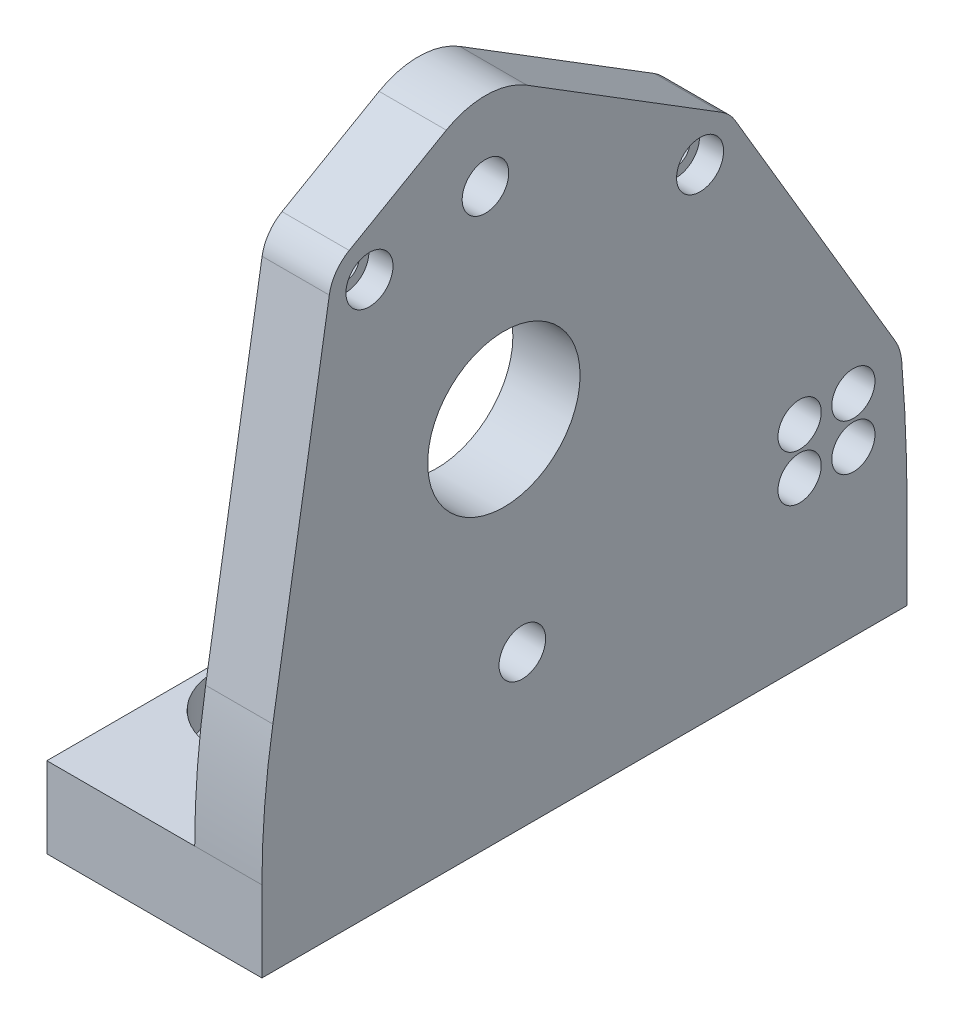
ISO-10303-21;
HEADER;
FILE_DESCRIPTION(('STEP AP214'),'2;1');
FILE_NAME('part.step','',(''),(''),'','','');
FILE_SCHEMA(('AUTOMOTIVE_DESIGN { 1 0 10303 214 1 1 1 1 }'));
ENDSEC;
DATA;
#1=APPLICATION_CONTEXT('core data for automotive mechanical design processes');
#2=APPLICATION_PROTOCOL_DEFINITION('international standard','automotive_design',2000,#1);
#3=PRODUCT_CONTEXT('',#1,'mechanical');
#4=PRODUCT('Part','Part','',(#3));
#5=PRODUCT_RELATED_PRODUCT_CATEGORY('part','',(#4));
#6=PRODUCT_DEFINITION_FORMATION('','',#4);
#7=PRODUCT_DEFINITION_CONTEXT('part definition',#1,'design');
#8=PRODUCT_DEFINITION('design','',#6,#7);
#9=PRODUCT_DEFINITION_SHAPE('','',#8);
#10=(LENGTH_UNIT() NAMED_UNIT(*) SI_UNIT(.MILLI.,.METRE.));
#11=(NAMED_UNIT(*) PLANE_ANGLE_UNIT() SI_UNIT($,.RADIAN.));
#12=(NAMED_UNIT(*) SI_UNIT($,.STERADIAN.) SOLID_ANGLE_UNIT());
#13=UNCERTAINTY_MEASURE_WITH_UNIT(LENGTH_MEASURE(1.E-05),#10,'distance_accuracy_value','');
#14=(GEOMETRIC_REPRESENTATION_CONTEXT(3) GLOBAL_UNCERTAINTY_ASSIGNED_CONTEXT((#13)) GLOBAL_UNIT_ASSIGNED_CONTEXT((#10,
#11,#12)) REPRESENTATION_CONTEXT('',''));
#15=CARTESIAN_POINT('',(0.,0.,0.));
#16=DIRECTION('',(0.,0.,1.));
#17=DIRECTION('',(1.,0.,0.));
#18=AXIS2_PLACEMENT_3D('',#15,#16,#17);
#19=CARTESIAN_POINT('',(25.4,79.375,76.2));
#20=DIRECTION('',(-1.,0.,0.));
#21=DIRECTION('',(0.,-1.,0.));
#22=AXIS2_PLACEMENT_3D('',#19,#20,#21);
#23=PLANE('',#22);
#24=CARTESIAN_POINT('',(25.4,42.8625,47.625));
#25=DIRECTION('',(1.,0.,0.));
#26=DIRECTION('',(0.,0.,-1.));
#27=AXIS2_PLACEMENT_3D('',#24,#25,#26);
#28=CIRCLE('',#27,8.99999999999999);
#29=CARTESIAN_POINT('',(25.4,42.8625,38.625));
#30=VERTEX_POINT('',#29);
#31=EDGE_CURVE('E282',#30,#30,#28,.T.);
#32=ORIENTED_EDGE('',*,*,#31,.F.);
#33=EDGE_LOOP('',(#32));
#34=FACE_BOUND('',#33,.T.);
#35=CARTESIAN_POINT('',(25.4,17.957632509851,45.4461064279965));
#36=DIRECTION('',(-1.,0.,0.));
#37=DIRECTION('',(0.,-1.,0.));
#38=AXIS2_PLACEMENT_3D('',#35,#36,#37);
#39=CIRCLE('',#38,2.74999999999999);
#40=CARTESIAN_POINT('',(25.4,15.207632509851,45.4461064279965));
#41=VERTEX_POINT('',#40);
#42=EDGE_CURVE('E281',#41,#41,#39,.T.);
#43=ORIENTED_EDGE('',*,*,#42,.T.);
#44=EDGE_LOOP('',(#43));
#45=FACE_BOUND('',#44,.T.);
#46=CARTESIAN_POINT('',(25.4,67.767367490149,49.8038935720035));
#47=DIRECTION('',(-1.,0.,0.));
#48=DIRECTION('',(0.,-1.,0.));
#49=AXIS2_PLACEMENT_3D('',#46,#47,#48);
#50=CIRCLE('',#49,2.74999999999999);
#51=CARTESIAN_POINT('',(25.4,65.017367490149,49.8038935720035));
#52=VERTEX_POINT('',#51);
#53=EDGE_CURVE('E271',#52,#52,#50,.T.);
#54=ORIENTED_EDGE('',*,*,#53,.T.);
#55=EDGE_LOOP('',(#54));
#56=FACE_BOUND('',#55,.T.);
#57=CARTESIAN_POINT('',(25.4,65.0875,63.5));
#58=DIRECTION('',(1.,0.,0.));
#59=DIRECTION('',(0.,0.,-1.));
#60=AXIS2_PLACEMENT_3D('',#57,#58,#59);
#61=CIRCLE('',#60,2.77876000000001);
#62=CARTESIAN_POINT('',(25.4,65.0875,60.72124));
#63=VERTEX_POINT('',#62);
#64=EDGE_CURVE('E252',#63,#63,#61,.T.);
#65=ORIENTED_EDGE('',*,*,#64,.F.);
#66=EDGE_LOOP('',(#65));
#67=FACE_BOUND('',#66,.T.);
#68=CARTESIAN_POINT('',(25.4,57.3206231212675,24.4532731370692));
#69=DIRECTION('',(1.,0.,0.));
#70=DIRECTION('',(0.,0.,-1.));
#71=AXIS2_PLACEMENT_3D('',#68,#69,#70);
#72=CIRCLE('',#71,2.77876);
#73=CARTESIAN_POINT('',(25.4,57.3206231212675,21.6745131370692));
#74=VERTEX_POINT('',#73);
#75=EDGE_CURVE('E242',#74,#74,#72,.T.);
#76=ORIENTED_EDGE('',*,*,#75,.F.);
#77=EDGE_LOOP('',(#76));
#78=FACE_BOUND('',#77,.T.);
#79=CARTESIAN_POINT('',(25.4,19.3959598742133,12.7));
#80=DIRECTION('',(-1.,0.,0.));
#81=DIRECTION('',(0.,0.,1.));
#82=AXIS2_PLACEMENT_3D('',#79,#80,#81);
#83=CIRCLE('',#82,2.5527);
#84=CARTESIAN_POINT('',(25.4,19.3959598742133,15.2527));
#85=VERTEX_POINT('',#84);
#86=EDGE_CURVE('E239',#85,#85,#83,.T.);
#87=ORIENTED_EDGE('',*,*,#86,.T.);
#88=EDGE_LOOP('',(#87));
#89=FACE_BOUND('',#88,.T.);
#90=CARTESIAN_POINT('',(25.4,19.3959598742133,6.35));
#91=DIRECTION('',(-1.,0.,0.));
#92=DIRECTION('',(0.,0.,1.));
#93=AXIS2_PLACEMENT_3D('',#90,#91,#92);
#94=CIRCLE('',#93,2.5527);
#95=CARTESIAN_POINT('',(25.4,19.3959598742133,8.9027));
#96=VERTEX_POINT('',#95);
#97=EDGE_CURVE('E233',#96,#96,#94,.T.);
#98=ORIENTED_EDGE('',*,*,#97,.T.);
#99=EDGE_LOOP('',(#98));
#100=FACE_BOUND('',#99,.T.);
#101=CARTESIAN_POINT('',(25.4,24.8635494141295,12.7));
#102=DIRECTION('',(-1.,0.,0.));
#103=DIRECTION('',(0.,0.,1.));
#104=AXIS2_PLACEMENT_3D('',#101,#102,#103);
#105=CIRCLE('',#104,2.5527);
#106=CARTESIAN_POINT('',(25.4,24.8635494141295,15.2527));
#107=VERTEX_POINT('',#106);
#108=EDGE_CURVE('E227',#107,#107,#105,.T.);
#109=ORIENTED_EDGE('',*,*,#108,.T.);
#110=EDGE_LOOP('',(#109));
#111=FACE_BOUND('',#110,.T.);
#112=CARTESIAN_POINT('',(25.4,24.8635494141295,6.35));
#113=DIRECTION('',(-1.,0.,0.));
#114=DIRECTION('',(0.,0.,1.));
#115=AXIS2_PLACEMENT_3D('',#112,#113,#114);
#116=CIRCLE('',#115,2.5527);
#117=CARTESIAN_POINT('',(25.4,24.8635494141295,8.9027));
#118=VERTEX_POINT('',#117);
#119=EDGE_CURVE('E221',#118,#118,#116,.T.);
#120=ORIENTED_EDGE('',*,*,#119,.T.);
#121=EDGE_LOOP('',(#120));
#122=FACE_BOUND('',#121,.T.);
#123=CARTESIAN_POINT('',(25.4,9.525,195.072353237744));
#124=DIRECTION('',(1.,0.,0.));
#125=DIRECTION('',(0.,0.,-1.));
#126=AXIS2_PLACEMENT_3D('',#123,#124,#125);
#127=CIRCLE('',#126,195.072353237744);
#128=CARTESIAN_POINT('',(25.4,9.52500000000002,0.));
#129=VERTEX_POINT('',#128);
#130=CARTESIAN_POINT('',(25.4,25.3275424975202,0.641124654665709));
#131=VERTEX_POINT('',#130);
#132=EDGE_CURVE('E48',#129,#131,#127,.T.);
#133=ORIENTED_EDGE('',*,*,#132,.T.);
#134=CARTESIAN_POINT('',(25.4,24.8635494141295,6.35));
#135=DIRECTION('',(1.,0.,0.));
#136=DIRECTION('',(0.,0.,-1.));
#137=AXIS2_PLACEMENT_3D('',#134,#135,#136);
#138=CIRCLE('',#137,5.7277);
#139=CARTESIAN_POINT('',(25.4,27.7766647313883,1.41843772843205));
#140=VERTEX_POINT('',#139);
#141=EDGE_CURVE('E181',#140,#131,#138,.F.);
#142=ORIENTED_EDGE('',*,*,#141,.F.);
#143=DIRECTION('',(0.,-0.861002194871929,-0.508601239111468));
#144=VECTOR('',#143,1.);
#145=CARTESIAN_POINT('',(25.4,6.56399136927082,-11.1120668638873));
#146=LINE('',#145,#144);
#147=CARTESIAN_POINT('',(25.4,59.7654438476144,20.3144786364296));
#148=VERTEX_POINT('',#147);
#149=EDGE_CURVE('E179',#148,#140,#146,.T.);
#150=ORIENTED_EDGE('',*,*,#149,.F.);
#151=CARTESIAN_POINT('',(25.4,57.3206231212675,24.4532731370692));
#152=DIRECTION('',(1.,0.,0.));
#153=DIRECTION('',(0.,0.,-1.));
#154=AXIS2_PLACEMENT_3D('',#151,#152,#153);
#155=CIRCLE('',#154,4.80694999999999);
#156=CARTESIAN_POINT('',(25.4,61.4052649655,21.9190140132136));
#157=VERTEX_POINT('',#156);
#158=EDGE_CURVE('E177',#157,#148,#155,.F.);
#159=ORIENTED_EDGE('',*,*,#158,.F.);
#160=DIRECTION('',(0.,0.527207298568868,0.849736702947281));
#161=VECTOR('',#160,1.);
#162=CARTESIAN_POINT('',(25.4,34.5183809760836,-21.416448556655));
#163=LINE('',#162,#161);
#164=CARTESIAN_POINT('',(25.4,75.665670144044,44.9035017318059));
#165=VERTEX_POINT('',#164);
#166=EDGE_CURVE('E174',#157,#165,#163,.T.);
#167=ORIENTED_EDGE('',*,*,#166,.T.);
#168=CARTESIAN_POINT('',(25.4,67.767367490149,49.8038935720035));
#169=DIRECTION('',(1.,0.,0.));
#170=DIRECTION('',(0.,0.,-1.));
#171=AXIS2_PLACEMENT_3D('',#168,#169,#170);
#172=CIRCLE('',#171,9.295);
#173=CARTESIAN_POINT('',(25.4,75.8308211157401,54.4275004571034));
#174=VERTEX_POINT('',#173);
#175=EDGE_CURVE('E172',#174,#165,#172,.F.);
#176=ORIENTED_EDGE('',*,*,#175,.F.);
#177=DIRECTION('',(0.,-0.497429465852599,0.867504424485315));
#178=VECTOR('',#177,1.);
#179=CARTESIAN_POINT('',(25.4,80.55421862798,46.1900144982694));
#180=LINE('',#179,#178);
#181=CARTESIAN_POINT('',(25.4,69.2575503932797,65.8911185708802));
#182=VERTEX_POINT('',#181);
#183=EDGE_CURVE('E167',#174,#182,#180,.T.);
#184=ORIENTED_EDGE('',*,*,#183,.T.);
#185=CARTESIAN_POINT('',(25.4,65.0875,63.5));
#186=DIRECTION('',(1.,0.,0.));
#187=DIRECTION('',(0.,0.,-1.));
#188=AXIS2_PLACEMENT_3D('',#185,#186,#187);
#189=CIRCLE('',#188,4.80694999999999);
#190=CARTESIAN_POINT('',(25.4,65.8674554174675,68.2432518222484));
#191=VERTEX_POINT('',#190);
#192=EDGE_CURVE('E165',#191,#182,#189,.F.);
#193=ORIENTED_EDGE('',*,*,#192,.F.);
#194=DIRECTION('',(0.,-0.986748733032055,0.162255779125535));
#195=VECTOR('',#194,1.);
#196=CARTESIAN_POINT('',(25.4,12.6602209498388,76.9923700067049));
#197=LINE('',#196,#195);
#198=CARTESIAN_POINT('',(25.4,25.3275424975202,74.9094221818446));
#199=VERTEX_POINT('',#198);
#200=EDGE_CURVE('E150',#191,#199,#197,.T.);
#201=ORIENTED_EDGE('',*,*,#200,.T.);
#202=CARTESIAN_POINT('',(25.4,9.525,-21.192786763509));
#203=DIRECTION('',(1.,0.,0.));
#204=DIRECTION('',(0.,0.,-1.));
#205=AXIS2_PLACEMENT_3D('',#202,#203,#204);
#206=CIRCLE('',#205,97.392786763509);
#207=CARTESIAN_POINT('',(25.4,9.525,76.2));
#208=VERTEX_POINT('',#207);
#209=EDGE_CURVE('E158',#199,#208,#206,.T.);
#210=ORIENTED_EDGE('',*,*,#209,.T.);
#211=DIRECTION('',(0.,1.,0.));
#212=VECTOR('',#211,1.);
#213=CARTESIAN_POINT('',(25.4,79.375,76.2));
#214=LINE('',#213,#212);
#215=CARTESIAN_POINT('',(25.4,0.,76.2));
#216=VERTEX_POINT('',#215);
#217=EDGE_CURVE('E81',#216,#208,#214,.T.);
#218=ORIENTED_EDGE('',*,*,#217,.F.);
#219=DIRECTION('',(0.,0.,-1.));
#220=VECTOR('',#219,1.);
#221=CARTESIAN_POINT('',(25.4,0.,76.2));
#222=LINE('',#221,#220);
#223=CARTESIAN_POINT('',(25.4,0.,0.));
#224=VERTEX_POINT('',#223);
#225=EDGE_CURVE('E310',#216,#224,#222,.T.);
#226=ORIENTED_EDGE('',*,*,#225,.T.);
#227=DIRECTION('',(0.,1.,0.));
#228=VECTOR('',#227,1.);
#229=CARTESIAN_POINT('',(25.4,79.375,0.));
#230=LINE('',#229,#228);
#231=EDGE_CURVE('E298',#224,#129,#230,.T.);
#232=ORIENTED_EDGE('',*,*,#231,.T.);
#233=EDGE_LOOP('',(#133,#142,#150,#159,#167,#176,#184,#193,#201,#210,#218,#226,#232));
#234=FACE_BOUND('',#233,.T.);
#235=ADVANCED_FACE('F33',(#34,#45,#56,#67,#78,#89,#100,#111,#122,#234),#23,.F.);
#236=CARTESIAN_POINT('',(17.4625,9.525,76.2));
#237=DIRECTION('',(1.,0.,0.));
#238=DIRECTION('',(0.,0.,-1.));
#239=AXIS2_PLACEMENT_3D('',#236,#237,#238);
#240=PLANE('',#239);
#241=CARTESIAN_POINT('',(17.4625,42.8625,47.625));
#242=DIRECTION('',(1.,0.,0.));
#243=DIRECTION('',(0.,0.,-1.));
#244=AXIS2_PLACEMENT_3D('',#241,#242,#243);
#245=CIRCLE('',#244,8.99999999999999);
#246=CARTESIAN_POINT('',(17.4625,42.8625,38.625));
#247=VERTEX_POINT('',#246);
#248=EDGE_CURVE('E285',#247,#247,#245,.T.);
#249=ORIENTED_EDGE('',*,*,#248,.T.);
#250=EDGE_LOOP('',(#249));
#251=FACE_BOUND('',#250,.T.);
#252=CARTESIAN_POINT('',(17.4625,17.957632509851,45.4461064279965));
#253=DIRECTION('',(-1.,0.,0.));
#254=DIRECTION('',(0.,0.,1.));
#255=AXIS2_PLACEMENT_3D('',#252,#253,#254);
#256=CIRCLE('',#255,6.12);
#257=CARTESIAN_POINT('',(17.4625,17.957632509851,51.5661064279965));
#258=VERTEX_POINT('',#257);
#259=EDGE_CURVE('E272',#258,#258,#256,.T.);
#260=ORIENTED_EDGE('',*,*,#259,.F.);
#261=EDGE_LOOP('',(#260));
#262=FACE_BOUND('',#261,.T.);
#263=CARTESIAN_POINT('',(17.4625,67.767367490149,49.8038935720035));
#264=DIRECTION('',(-1.,0.,0.));
#265=DIRECTION('',(0.,0.,1.));
#266=AXIS2_PLACEMENT_3D('',#263,#264,#265);
#267=CIRCLE('',#266,6.12);
#268=CARTESIAN_POINT('',(17.4625,67.767367490149,55.9238935720035));
#269=VERTEX_POINT('',#268);
#270=EDGE_CURVE('E262',#269,#269,#267,.T.);
#271=ORIENTED_EDGE('',*,*,#270,.F.);
#272=EDGE_LOOP('',(#271));
#273=FACE_BOUND('',#272,.T.);
#274=CARTESIAN_POINT('',(17.4625,65.0875,63.5));
#275=DIRECTION('',(1.,0.,0.));
#276=DIRECTION('',(0.,0.,-1.));
#277=AXIS2_PLACEMENT_3D('',#274,#275,#276);
#278=CIRCLE('',#277,1.63194999999999);
#279=CARTESIAN_POINT('',(17.4625,65.0875,61.86805));
#280=VERTEX_POINT('',#279);
#281=EDGE_CURVE('E261',#280,#280,#278,.T.);
#282=ORIENTED_EDGE('',*,*,#281,.T.);
#283=EDGE_LOOP('',(#282));
#284=FACE_BOUND('',#283,.T.);
#285=CARTESIAN_POINT('',(17.4625,57.3206231212675,24.4532731370692));
#286=DIRECTION('',(1.,0.,0.));
#287=DIRECTION('',(0.,0.,-1.));
#288=AXIS2_PLACEMENT_3D('',#285,#286,#287);
#289=CIRCLE('',#288,1.63194999999999);
#290=CARTESIAN_POINT('',(17.4625,57.3206231212675,22.8213231370692));
#291=VERTEX_POINT('',#290);
#292=EDGE_CURVE('E251',#291,#291,#289,.T.);
#293=ORIENTED_EDGE('',*,*,#292,.T.);
#294=EDGE_LOOP('',(#293));
#295=FACE_BOUND('',#294,.T.);
#296=CARTESIAN_POINT('',(17.4625,19.3959598742133,12.7));
#297=DIRECTION('',(-1.,0.,0.));
#298=DIRECTION('',(0.,0.,1.));
#299=AXIS2_PLACEMENT_3D('',#296,#297,#298);
#300=CIRCLE('',#299,2.5527);
#301=CARTESIAN_POINT('',(17.4625,19.3959598742133,15.2527));
#302=VERTEX_POINT('',#301);
#303=EDGE_CURVE('E236',#302,#302,#300,.T.);
#304=ORIENTED_EDGE('',*,*,#303,.F.);
#305=EDGE_LOOP('',(#304));
#306=FACE_BOUND('',#305,.T.);
#307=CARTESIAN_POINT('',(17.4625,19.3959598742133,6.35));
#308=DIRECTION('',(-1.,0.,0.));
#309=DIRECTION('',(0.,0.,1.));
#310=AXIS2_PLACEMENT_3D('',#307,#308,#309);
#311=CIRCLE('',#310,2.5527);
#312=CARTESIAN_POINT('',(17.4625,19.3959598742133,8.9027));
#313=VERTEX_POINT('',#312);
#314=EDGE_CURVE('E230',#313,#313,#311,.T.);
#315=ORIENTED_EDGE('',*,*,#314,.F.);
#316=EDGE_LOOP('',(#315));
#317=FACE_BOUND('',#316,.T.);
#318=CARTESIAN_POINT('',(17.4625,24.8635494141295,12.7));
#319=DIRECTION('',(-1.,0.,0.));
#320=DIRECTION('',(0.,0.,1.));
#321=AXIS2_PLACEMENT_3D('',#318,#319,#320);
#322=CIRCLE('',#321,2.5527);
#323=CARTESIAN_POINT('',(17.4625,24.8635494141295,15.2527));
#324=VERTEX_POINT('',#323);
#325=EDGE_CURVE('E224',#324,#324,#322,.T.);
#326=ORIENTED_EDGE('',*,*,#325,.F.);
#327=EDGE_LOOP('',(#326));
#328=FACE_BOUND('',#327,.T.);
#329=CARTESIAN_POINT('',(17.4625,24.8635494141295,6.35));
#330=DIRECTION('',(-1.,0.,0.));
#331=DIRECTION('',(0.,0.,1.));
#332=AXIS2_PLACEMENT_3D('',#329,#330,#331);
#333=CIRCLE('',#332,2.5527);
#334=CARTESIAN_POINT('',(17.4625,24.8635494141295,8.9027));
#335=VERTEX_POINT('',#334);
#336=EDGE_CURVE('E218',#335,#335,#333,.T.);
#337=ORIENTED_EDGE('',*,*,#336,.F.);
#338=EDGE_LOOP('',(#337));
#339=FACE_BOUND('',#338,.T.);
#340=CARTESIAN_POINT('',(17.4625,9.525,195.072353237744));
#341=DIRECTION('',(1.,0.,0.));
#342=DIRECTION('',(0.,0.,-1.));
#343=AXIS2_PLACEMENT_3D('',#340,#341,#342);
#344=CIRCLE('',#343,195.072353237744);
#345=CARTESIAN_POINT('',(17.4625,9.525,0.));
#346=VERTEX_POINT('',#345);
#347=CARTESIAN_POINT('',(17.4625,25.3275424975202,0.641124654665709));
#348=VERTEX_POINT('',#347);
#349=EDGE_CURVE('E211',#346,#348,#344,.T.);
#350=ORIENTED_EDGE('',*,*,#349,.F.);
#351=DIRECTION('',(0.,0.,-1.));
#352=VECTOR('',#351,1.);
#353=CARTESIAN_POINT('',(17.4625,9.525,76.2));
#354=LINE('',#353,#352);
#355=CARTESIAN_POINT('',(17.4625,9.525,76.2));
#356=VERTEX_POINT('',#355);
#357=EDGE_CURVE('E307',#356,#346,#354,.T.);
#358=ORIENTED_EDGE('',*,*,#357,.F.);
#359=CARTESIAN_POINT('',(17.4625,9.525,-21.192786763509));
#360=DIRECTION('',(1.,0.,0.));
#361=DIRECTION('',(0.,0.,-1.));
#362=AXIS2_PLACEMENT_3D('',#359,#360,#361);
#363=CIRCLE('',#362,97.392786763509);
#364=CARTESIAN_POINT('',(17.4625,25.3275424975202,74.9094221818446));
#365=VERTEX_POINT('',#364);
#366=EDGE_CURVE('E216',#356,#365,#363,.F.);
#367=ORIENTED_EDGE('',*,*,#366,.T.);
#368=DIRECTION('',(0.,0.986748733032055,-0.162255779125535));
#369=VECTOR('',#368,1.);
#370=CARTESIAN_POINT('',(17.4625,9.73440370940694,77.4734760269442));
#371=LINE('',#370,#369);
#372=CARTESIAN_POINT('',(17.4625,65.8674554174675,68.2432518222484));
#373=VERTEX_POINT('',#372);
#374=EDGE_CURVE('E41',#365,#373,#371,.T.);
#375=ORIENTED_EDGE('',*,*,#374,.T.);
#376=CARTESIAN_POINT('',(17.4625,65.0875,63.5));
#377=DIRECTION('',(1.,0.,0.));
#378=DIRECTION('',(0.,0.,-1.));
#379=AXIS2_PLACEMENT_3D('',#376,#377,#378);
#380=CIRCLE('',#379,4.80694999999999);
#381=CARTESIAN_POINT('',(17.4625,69.2575503932797,65.8911185708802));
#382=VERTEX_POINT('',#381);
#383=EDGE_CURVE('E332',#382,#373,#380,.T.);
#384=ORIENTED_EDGE('',*,*,#383,.F.);
#385=DIRECTION('',(0.,0.497429465852599,-0.867504424485315));
#386=VECTOR('',#385,1.);
#387=CARTESIAN_POINT('',(17.4625,50.0290508258192,99.425136147412));
#388=LINE('',#387,#386);
#389=CARTESIAN_POINT('',(17.4625,75.8308211157401,54.4275004571034));
#390=VERTEX_POINT('',#389);
#391=EDGE_CURVE('E329',#382,#390,#388,.T.);
#392=ORIENTED_EDGE('',*,*,#391,.T.);
#393=CARTESIAN_POINT('',(17.4625,67.767367490149,49.8038935720035));
#394=DIRECTION('',(1.,0.,0.));
#395=DIRECTION('',(0.,0.,-1.));
#396=AXIS2_PLACEMENT_3D('',#393,#394,#395);
#397=CIRCLE('',#396,9.295);
#398=CARTESIAN_POINT('',(17.4625,75.665670144044,44.9035017318059));
#399=VERTEX_POINT('',#398);
#400=EDGE_CURVE('E327',#399,#390,#397,.T.);
#401=ORIENTED_EDGE('',*,*,#400,.F.);
#402=DIRECTION('',(0.,-0.527207298568868,-0.849736702947281));
#403=VECTOR('',#402,1.);
#404=CARTESIAN_POINT('',(17.4625,71.3024704974467,37.8710291312467));
#405=LINE('',#404,#403);
#406=CARTESIAN_POINT('',(17.4625,61.4052649655,21.9190140132136));
#407=VERTEX_POINT('',#406);
#408=EDGE_CURVE('E324',#399,#407,#405,.T.);
#409=ORIENTED_EDGE('',*,*,#408,.T.);
#410=CARTESIAN_POINT('',(17.4625,57.3206231212675,24.4532731370692));
#411=DIRECTION('',(1.,0.,0.));
#412=DIRECTION('',(0.,0.,-1.));
#413=AXIS2_PLACEMENT_3D('',#410,#411,#412);
#414=CIRCLE('',#413,4.80694999999999);
#415=CARTESIAN_POINT('',(17.4625,59.7654438476144,20.3144786364296));
#416=VERTEX_POINT('',#415);
#417=EDGE_CURVE('E322',#416,#407,#414,.T.);
#418=ORIENTED_EDGE('',*,*,#417,.F.);
#419=DIRECTION('',(0.,0.861002194871929,0.508601239111468));
#420=VECTOR('',#419,1.);
#421=CARTESIAN_POINT('',(17.4625,46.9936067737601,12.7700470424331));
#422=LINE('',#421,#420);
#423=CARTESIAN_POINT('',(17.4625,27.7766647313883,1.41843772843204));
#424=VERTEX_POINT('',#423);
#425=EDGE_CURVE('E312',#424,#416,#422,.T.);
#426=ORIENTED_EDGE('',*,*,#425,.F.);
#427=CARTESIAN_POINT('',(17.4625,24.8635494141295,6.35));
#428=DIRECTION('',(1.,0.,0.));
#429=DIRECTION('',(0.,0.,-1.));
#430=AXIS2_PLACEMENT_3D('',#427,#428,#429);
#431=CIRCLE('',#430,5.7277);
#432=EDGE_CURVE('E11',#424,#348,#431,.F.);
#433=ORIENTED_EDGE('',*,*,#432,.T.);
#434=EDGE_LOOP('',(#350,#358,#367,#375,#384,#392,#401,#409,#418,#426,#433));
#435=FACE_BOUND('',#434,.T.);
#436=ADVANCED_FACE('F336',(#251,#262,#273,#284,#295,#306,#317,#328,#339,#435),#240,.F.);
#437=CARTESIAN_POINT('',(0.,0.,76.2));
#438=DIRECTION('',(0.,0.,-1.));
#439=DIRECTION('',(-1.,0.,0.));
#440=AXIS2_PLACEMENT_3D('',#437,#438,#439);
#441=PLANE('',#440);
#442=DIRECTION('',(-1.,0.,0.));
#443=VECTOR('',#442,1.);
#444=CARTESIAN_POINT('',(25.4,9.525,76.2));
#445=LINE('',#444,#443);
#446=EDGE_CURVE('E161',#208,#356,#445,.T.);
#447=ORIENTED_EDGE('',*,*,#446,.T.);
#448=DIRECTION('',(-1.,0.,0.));
#449=VECTOR('',#448,1.);
#450=CARTESIAN_POINT('',(0.,9.525,76.2));
#451=LINE('',#450,#449);
#452=CARTESIAN_POINT('',(0.,9.525,76.2));
#453=VERTEX_POINT('',#452);
#454=EDGE_CURVE('E292',#356,#453,#451,.T.);
#455=ORIENTED_EDGE('',*,*,#454,.T.);
#456=DIRECTION('',(0.,-1.,0.));
#457=VECTOR('',#456,1.);
#458=CARTESIAN_POINT('',(0.,0.,76.2));
#459=LINE('',#458,#457);
#460=CARTESIAN_POINT('',(0.,0.,76.2));
#461=VERTEX_POINT('',#460);
#462=EDGE_CURVE('E57',#453,#461,#459,.T.);
#463=ORIENTED_EDGE('',*,*,#462,.T.);
#464=DIRECTION('',(1.,0.,0.));
#465=VECTOR('',#464,1.);
#466=CARTESIAN_POINT('',(25.4,0.,76.2));
#467=LINE('',#466,#465);
#468=EDGE_CURVE('E289',#461,#216,#467,.T.);
#469=ORIENTED_EDGE('',*,*,#468,.T.);
#470=ORIENTED_EDGE('',*,*,#217,.T.);
#471=EDGE_LOOP('',(#447,#455,#463,#469,#470));
#472=FACE_BOUND('',#471,.T.);
#473=ADVANCED_FACE('F339',(#472),#441,.F.);
#474=CARTESIAN_POINT('',(0.,0.,0.));
#475=DIRECTION('',(0.,0.,-1.));
#476=DIRECTION('',(-1.,0.,0.));
#477=AXIS2_PLACEMENT_3D('',#474,#475,#476);
#478=PLANE('',#477);
#479=DIRECTION('',(-1.,0.,0.));
#480=VECTOR('',#479,1.);
#481=CARTESIAN_POINT('',(0.,9.525,0.));
#482=LINE('',#481,#480);
#483=CARTESIAN_POINT('',(0.,9.525,0.));
#484=VERTEX_POINT('',#483);
#485=EDGE_CURVE('E301',#346,#484,#482,.T.);
#486=ORIENTED_EDGE('',*,*,#485,.F.);
#487=DIRECTION('',(-1.,0.,0.));
#488=VECTOR('',#487,1.);
#489=CARTESIAN_POINT('',(25.4,9.525,0.));
#490=LINE('',#489,#488);
#491=EDGE_CURVE('E186',#129,#346,#490,.T.);
#492=ORIENTED_EDGE('',*,*,#491,.F.);
#493=ORIENTED_EDGE('',*,*,#231,.F.);
#494=DIRECTION('',(1.,0.,0.));
#495=VECTOR('',#494,1.);
#496=CARTESIAN_POINT('',(25.4,0.,0.));
#497=LINE('',#496,#495);
#498=CARTESIAN_POINT('',(0.,0.,0.));
#499=VERTEX_POINT('',#498);
#500=EDGE_CURVE('E288',#499,#224,#497,.T.);
#501=ORIENTED_EDGE('',*,*,#500,.F.);
#502=DIRECTION('',(0.,-1.,0.));
#503=VECTOR('',#502,1.);
#504=CARTESIAN_POINT('',(0.,0.,0.));
#505=LINE('',#504,#503);
#506=EDGE_CURVE('E74',#484,#499,#505,.T.);
#507=ORIENTED_EDGE('',*,*,#506,.F.);
#508=EDGE_LOOP('',(#486,#492,#493,#501,#507));
#509=FACE_BOUND('',#508,.T.);
#510=ADVANCED_FACE('F348',(#509),#478,.T.);
#511=CARTESIAN_POINT('',(25.4,0.,76.2));
#512=DIRECTION('',(0.,1.,0.));
#513=DIRECTION('',(0.,0.,1.));
#514=AXIS2_PLACEMENT_3D('',#511,#512,#513);
#515=PLANE('',#514);
#516=CARTESIAN_POINT('',(8.73124999999999,0.,19.05));
#517=DIRECTION('',(0.,1.,0.));
#518=DIRECTION('',(0.,0.,1.));
#519=AXIS2_PLACEMENT_3D('',#516,#517,#518);
#520=CIRCLE('',#519,3.3782);
#521=CARTESIAN_POINT('',(8.73124999999999,0.,22.4282));
#522=VERTEX_POINT('',#521);
#523=EDGE_CURVE('E477',#522,#522,#520,.T.);
#524=ORIENTED_EDGE('',*,*,#523,.T.);
#525=EDGE_LOOP('',(#524));
#526=FACE_BOUND('',#525,.T.);
#527=CARTESIAN_POINT('',(8.73124999999999,0.,57.15));
#528=DIRECTION('',(0.,1.,0.));
#529=DIRECTION('',(0.,0.,1.));
#530=AXIS2_PLACEMENT_3D('',#527,#528,#529);
#531=CIRCLE('',#530,3.3782);
#532=CARTESIAN_POINT('',(8.73124999999999,0.,60.5282));
#533=VERTEX_POINT('',#532);
#534=EDGE_CURVE('E162',#533,#533,#531,.T.);
#535=ORIENTED_EDGE('',*,*,#534,.T.);
#536=EDGE_LOOP('',(#535));
#537=FACE_BOUND('',#536,.T.);
#538=ORIENTED_EDGE('',*,*,#500,.T.);
#539=ORIENTED_EDGE('',*,*,#225,.F.);
#540=ORIENTED_EDGE('',*,*,#468,.F.);
#541=DIRECTION('',(0.,0.,-1.));
#542=VECTOR('',#541,1.);
#543=CARTESIAN_POINT('',(0.,0.,76.2));
#544=LINE('',#543,#542);
#545=EDGE_CURVE('E295',#461,#499,#544,.T.);
#546=ORIENTED_EDGE('',*,*,#545,.T.);
#547=EDGE_LOOP('',(#538,#539,#540,#546));
#548=FACE_BOUND('',#547,.T.);
#549=ADVANCED_FACE('F35',(#526,#537,#548),#515,.F.);
#550=CARTESIAN_POINT('',(0.,9.525,76.2));
#551=DIRECTION('',(0.,-1.,0.));
#552=DIRECTION('',(0.,0.,-1.));
#553=AXIS2_PLACEMENT_3D('',#550,#551,#552);
#554=PLANE('',#553);
#555=CARTESIAN_POINT('',(8.73124999999999,9.525,19.05));
#556=DIRECTION('',(0.,1.,0.));
#557=DIRECTION('',(0.,0.,1.));
#558=AXIS2_PLACEMENT_3D('',#555,#556,#557);
#559=CIRCLE('',#558,7.9375);
#560=CARTESIAN_POINT('',(8.73124999999999,9.525,26.9875));
#561=VERTEX_POINT('',#560);
#562=EDGE_CURVE('E498',#561,#561,#559,.T.);
#563=ORIENTED_EDGE('',*,*,#562,.F.);
#564=EDGE_LOOP('',(#563));
#565=FACE_BOUND('',#564,.T.);
#566=CARTESIAN_POINT('',(8.73124999999999,9.525,57.15));
#567=DIRECTION('',(0.,1.,0.));
#568=DIRECTION('',(0.,0.,1.));
#569=AXIS2_PLACEMENT_3D('',#566,#567,#568);
#570=CIRCLE('',#569,7.9375);
#571=CARTESIAN_POINT('',(8.73124999999999,9.525,65.0875));
#572=VERTEX_POINT('',#571);
#573=EDGE_CURVE('E488',#572,#572,#570,.T.);
#574=ORIENTED_EDGE('',*,*,#573,.F.);
#575=EDGE_LOOP('',(#574));
#576=FACE_BOUND('',#575,.T.);
#577=ORIENTED_EDGE('',*,*,#485,.T.);
#578=DIRECTION('',(0.,0.,-1.));
#579=VECTOR('',#578,1.);
#580=CARTESIAN_POINT('',(0.,9.525,76.2));
#581=LINE('',#580,#579);
#582=EDGE_CURVE('E305',#453,#484,#581,.T.);
#583=ORIENTED_EDGE('',*,*,#582,.F.);
#584=ORIENTED_EDGE('',*,*,#454,.F.);
#585=ORIENTED_EDGE('',*,*,#357,.T.);
#586=EDGE_LOOP('',(#577,#583,#584,#585));
#587=FACE_BOUND('',#586,.T.);
#588=ADVANCED_FACE('F353',(#565,#576,#587),#554,.F.);
#589=CARTESIAN_POINT('',(0.,0.,76.2));
#590=DIRECTION('',(1.,0.,0.));
#591=DIRECTION('',(0.,0.,-1.));
#592=AXIS2_PLACEMENT_3D('',#589,#590,#591);
#593=PLANE('',#592);
#594=ORIENTED_EDGE('',*,*,#506,.T.);
#595=ORIENTED_EDGE('',*,*,#545,.F.);
#596=ORIENTED_EDGE('',*,*,#462,.F.);
#597=ORIENTED_EDGE('',*,*,#582,.T.);
#598=EDGE_LOOP('',(#594,#595,#596,#597));
#599=FACE_BOUND('',#598,.T.);
#600=ADVANCED_FACE('F354',(#599),#593,.F.);
#601=CARTESIAN_POINT('',(25.4,42.8625,47.625));
#602=DIRECTION('',(1.,0.,0.));
#603=DIRECTION('',(0.,0.,-1.));
#604=AXIS2_PLACEMENT_3D('',#601,#602,#603);
#605=CYLINDRICAL_SURFACE('',#604,8.99999999999999);
#606=ORIENTED_EDGE('',*,*,#31,.T.);
#607=EDGE_LOOP('',(#606));
#608=FACE_BOUND('',#607,.T.);
#609=ORIENTED_EDGE('',*,*,#248,.F.);
#610=EDGE_LOOP('',(#609));
#611=FACE_BOUND('',#610,.T.);
#612=ADVANCED_FACE('F356',(#608,#611),#605,.F.);
#613=CARTESIAN_POINT('',(17.4625,17.957632509851,45.4461064279965));
#614=DIRECTION('',(-1.,0.,0.));
#615=DIRECTION('',(0.,0.,1.));
#616=AXIS2_PLACEMENT_3D('',#613,#614,#615);
#617=CYLINDRICAL_SURFACE('',#616,2.74999999999999);
#618=CARTESIAN_POINT('',(21.0425,17.957632509851,45.4461064279965));
#619=DIRECTION('',(-1.,0.,0.));
#620=DIRECTION('',(0.,0.,1.));
#621=AXIS2_PLACEMENT_3D('',#618,#619,#620);
#622=CIRCLE('',#621,2.75);
#623=CARTESIAN_POINT('',(21.0425,17.957632509851,48.1961064279965));
#624=VERTEX_POINT('',#623);
#625=EDGE_CURVE('E278',#624,#624,#622,.T.);
#626=ORIENTED_EDGE('',*,*,#625,.T.);
#627=EDGE_LOOP('',(#626));
#628=FACE_BOUND('',#627,.T.);
#629=ORIENTED_EDGE('',*,*,#42,.F.);
#630=EDGE_LOOP('',(#629));
#631=FACE_BOUND('',#630,.T.);
#632=ADVANCED_FACE('F362',(#628,#631),#617,.F.);
#633=CARTESIAN_POINT('',(21.0425,20.707632509851,45.4461064279965));
#634=DIRECTION('',(1.,0.,0.));
#635=DIRECTION('',(0.,0.,-1.));
#636=AXIS2_PLACEMENT_3D('',#633,#634,#635);
#637=PLANE('',#636);
#638=ORIENTED_EDGE('',*,*,#625,.F.);
#639=EDGE_LOOP('',(#638));
#640=FACE_BOUND('',#639,.T.);
#641=CARTESIAN_POINT('',(21.0425,17.957632509851,45.4461064279965));
#642=DIRECTION('',(-1.,0.,0.));
#643=DIRECTION('',(0.,0.,1.));
#644=AXIS2_PLACEMENT_3D('',#641,#642,#643);
#645=CIRCLE('',#644,6.12);
#646=CARTESIAN_POINT('',(21.0425,17.957632509851,51.5661064279965));
#647=VERTEX_POINT('',#646);
#648=EDGE_CURVE('E275',#647,#647,#645,.T.);
#649=ORIENTED_EDGE('',*,*,#648,.T.);
#650=EDGE_LOOP('',(#649));
#651=FACE_BOUND('',#650,.T.);
#652=ADVANCED_FACE('F458',(#640,#651),#637,.F.);
#653=CARTESIAN_POINT('',(17.4625,17.957632509851,45.4461064279965));
#654=DIRECTION('',(-1.,0.,0.));
#655=DIRECTION('',(0.,0.,1.));
#656=AXIS2_PLACEMENT_3D('',#653,#654,#655);
#657=CYLINDRICAL_SURFACE('',#656,6.12);
#658=ORIENTED_EDGE('',*,*,#648,.F.);
#659=EDGE_LOOP('',(#658));
#660=FACE_BOUND('',#659,.T.);
#661=ORIENTED_EDGE('',*,*,#259,.T.);
#662=EDGE_LOOP('',(#661));
#663=FACE_BOUND('',#662,.T.);
#664=ADVANCED_FACE('F454',(#660,#663),#657,.F.);
#665=CARTESIAN_POINT('',(17.4625,67.767367490149,49.8038935720035));
#666=DIRECTION('',(-1.,0.,0.));
#667=DIRECTION('',(0.,0.,1.));
#668=AXIS2_PLACEMENT_3D('',#665,#666,#667);
#669=CYLINDRICAL_SURFACE('',#668,2.74999999999999);
#670=CARTESIAN_POINT('',(21.0425,67.767367490149,49.8038935720035));
#671=DIRECTION('',(-1.,0.,0.));
#672=DIRECTION('',(0.,0.,1.));
#673=AXIS2_PLACEMENT_3D('',#670,#671,#672);
#674=CIRCLE('',#673,2.74999999999999);
#675=CARTESIAN_POINT('',(21.0425,67.767367490149,52.5538935720035));
#676=VERTEX_POINT('',#675);
#677=EDGE_CURVE('E268',#676,#676,#674,.T.);
#678=ORIENTED_EDGE('',*,*,#677,.T.);
#679=EDGE_LOOP('',(#678));
#680=FACE_BOUND('',#679,.T.);
#681=ORIENTED_EDGE('',*,*,#53,.F.);
#682=EDGE_LOOP('',(#681));
#683=FACE_BOUND('',#682,.T.);
#684=ADVANCED_FACE('F450',(#680,#683),#669,.F.);
#685=CARTESIAN_POINT('',(21.0425,70.517367490149,49.8038935720035));
#686=DIRECTION('',(1.,0.,0.));
#687=DIRECTION('',(0.,0.,-1.));
#688=AXIS2_PLACEMENT_3D('',#685,#686,#687);
#689=PLANE('',#688);
#690=ORIENTED_EDGE('',*,*,#677,.F.);
#691=EDGE_LOOP('',(#690));
#692=FACE_BOUND('',#691,.T.);
#693=CARTESIAN_POINT('',(21.0425,67.767367490149,49.8038935720035));
#694=DIRECTION('',(-1.,0.,0.));
#695=DIRECTION('',(0.,0.,1.));
#696=AXIS2_PLACEMENT_3D('',#693,#694,#695);
#697=CIRCLE('',#696,6.12);
#698=CARTESIAN_POINT('',(21.0425,67.767367490149,55.9238935720035));
#699=VERTEX_POINT('',#698);
#700=EDGE_CURVE('E265',#699,#699,#697,.T.);
#701=ORIENTED_EDGE('',*,*,#700,.T.);
#702=EDGE_LOOP('',(#701));
#703=FACE_BOUND('',#702,.T.);
#704=ADVANCED_FACE('F446',(#692,#703),#689,.F.);
#705=CARTESIAN_POINT('',(17.4625,67.767367490149,49.8038935720035));
#706=DIRECTION('',(-1.,0.,0.));
#707=DIRECTION('',(0.,0.,1.));
#708=AXIS2_PLACEMENT_3D('',#705,#706,#707);
#709=CYLINDRICAL_SURFACE('',#708,6.12);
#710=ORIENTED_EDGE('',*,*,#700,.F.);
#711=EDGE_LOOP('',(#710));
#712=FACE_BOUND('',#711,.T.);
#713=ORIENTED_EDGE('',*,*,#270,.T.);
#714=EDGE_LOOP('',(#713));
#715=FACE_BOUND('',#714,.T.);
#716=ADVANCED_FACE('F442',(#712,#715),#709,.F.);
#717=CARTESIAN_POINT('',(25.4,65.0875,63.5));
#718=DIRECTION('',(1.,0.,0.));
#719=DIRECTION('',(0.,0.,-1.));
#720=AXIS2_PLACEMENT_3D('',#717,#718,#719);
#721=CYLINDRICAL_SURFACE('',#720,1.63194999999999);
#722=CARTESIAN_POINT('',(22.5552,65.0875,63.5));
#723=DIRECTION('',(1.,0.,0.));
#724=DIRECTION('',(0.,0.,-1.));
#725=AXIS2_PLACEMENT_3D('',#722,#723,#724);
#726=CIRCLE('',#725,1.63194999999999);
#727=CARTESIAN_POINT('',(22.5552,65.0875,61.86805));
#728=VERTEX_POINT('',#727);
#729=EDGE_CURVE('E258',#728,#728,#726,.T.);
#730=ORIENTED_EDGE('',*,*,#729,.T.);
#731=EDGE_LOOP('',(#730));
#732=FACE_BOUND('',#731,.T.);
#733=ORIENTED_EDGE('',*,*,#281,.F.);
#734=EDGE_LOOP('',(#733));
#735=FACE_BOUND('',#734,.T.);
#736=ADVANCED_FACE('F438',(#732,#735),#721,.F.);
#737=CARTESIAN_POINT('',(22.5552,66.71945,63.5));
#738=DIRECTION('',(-1.,0.,0.));
#739=DIRECTION('',(0.,0.,1.));
#740=AXIS2_PLACEMENT_3D('',#737,#738,#739);
#741=PLANE('',#740);
#742=ORIENTED_EDGE('',*,*,#729,.F.);
#743=EDGE_LOOP('',(#742));
#744=FACE_BOUND('',#743,.T.);
#745=CARTESIAN_POINT('',(22.5552,65.0875,63.5));
#746=DIRECTION('',(1.,0.,0.));
#747=DIRECTION('',(0.,0.,-1.));
#748=AXIS2_PLACEMENT_3D('',#745,#746,#747);
#749=CIRCLE('',#748,2.77876000000001);
#750=CARTESIAN_POINT('',(22.5552,65.0875,60.72124));
#751=VERTEX_POINT('',#750);
#752=EDGE_CURVE('E255',#751,#751,#749,.T.);
#753=ORIENTED_EDGE('',*,*,#752,.T.);
#754=EDGE_LOOP('',(#753));
#755=FACE_BOUND('',#754,.T.);
#756=ADVANCED_FACE('F434',(#744,#755),#741,.F.);
#757=CARTESIAN_POINT('',(25.4,65.0875,63.5));
#758=DIRECTION('',(1.,0.,0.));
#759=DIRECTION('',(0.,0.,-1.));
#760=AXIS2_PLACEMENT_3D('',#757,#758,#759);
#761=CYLINDRICAL_SURFACE('',#760,2.77876000000001);
#762=ORIENTED_EDGE('',*,*,#752,.F.);
#763=EDGE_LOOP('',(#762));
#764=FACE_BOUND('',#763,.T.);
#765=ORIENTED_EDGE('',*,*,#64,.T.);
#766=EDGE_LOOP('',(#765));
#767=FACE_BOUND('',#766,.T.);
#768=ADVANCED_FACE('F430',(#764,#767),#761,.F.);
#769=CARTESIAN_POINT('',(25.4,57.3206231212675,24.4532731370692));
#770=DIRECTION('',(1.,0.,0.));
#771=DIRECTION('',(0.,0.,-1.));
#772=AXIS2_PLACEMENT_3D('',#769,#770,#771);
#773=CYLINDRICAL_SURFACE('',#772,1.63194999999999);
#774=CARTESIAN_POINT('',(22.5552,57.3206231212675,24.4532731370692));
#775=DIRECTION('',(1.,0.,0.));
#776=DIRECTION('',(0.,0.,-1.));
#777=AXIS2_PLACEMENT_3D('',#774,#775,#776);
#778=CIRCLE('',#777,1.63194999999999);
#779=CARTESIAN_POINT('',(22.5552,57.3206231212675,22.8213231370692));
#780=VERTEX_POINT('',#779);
#781=EDGE_CURVE('E248',#780,#780,#778,.T.);
#782=ORIENTED_EDGE('',*,*,#781,.T.);
#783=EDGE_LOOP('',(#782));
#784=FACE_BOUND('',#783,.T.);
#785=ORIENTED_EDGE('',*,*,#292,.F.);
#786=EDGE_LOOP('',(#785));
#787=FACE_BOUND('',#786,.T.);
#788=ADVANCED_FACE('F426',(#784,#787),#773,.F.);
#789=CARTESIAN_POINT('',(22.5552,58.9525731212675,24.4532731370692));
#790=DIRECTION('',(-1.,0.,0.));
#791=DIRECTION('',(0.,0.,1.));
#792=AXIS2_PLACEMENT_3D('',#789,#790,#791);
#793=PLANE('',#792);
#794=ORIENTED_EDGE('',*,*,#781,.F.);
#795=EDGE_LOOP('',(#794));
#796=FACE_BOUND('',#795,.T.);
#797=CARTESIAN_POINT('',(22.5552,57.3206231212675,24.4532731370692));
#798=DIRECTION('',(1.,0.,0.));
#799=DIRECTION('',(0.,0.,-1.));
#800=AXIS2_PLACEMENT_3D('',#797,#798,#799);
#801=CIRCLE('',#800,2.77876);
#802=CARTESIAN_POINT('',(22.5552,57.3206231212675,21.6745131370692));
#803=VERTEX_POINT('',#802);
#804=EDGE_CURVE('E245',#803,#803,#801,.T.);
#805=ORIENTED_EDGE('',*,*,#804,.T.);
#806=EDGE_LOOP('',(#805));
#807=FACE_BOUND('',#806,.T.);
#808=ADVANCED_FACE('F422',(#796,#807),#793,.F.);
#809=CARTESIAN_POINT('',(25.4,57.3206231212675,24.4532731370692));
#810=DIRECTION('',(1.,0.,0.));
#811=DIRECTION('',(0.,0.,-1.));
#812=AXIS2_PLACEMENT_3D('',#809,#810,#811);
#813=CYLINDRICAL_SURFACE('',#812,2.77876);
#814=ORIENTED_EDGE('',*,*,#804,.F.);
#815=EDGE_LOOP('',(#814));
#816=FACE_BOUND('',#815,.T.);
#817=ORIENTED_EDGE('',*,*,#75,.T.);
#818=EDGE_LOOP('',(#817));
#819=FACE_BOUND('',#818,.T.);
#820=ADVANCED_FACE('F418',(#816,#819),#813,.F.);
#821=CARTESIAN_POINT('',(17.4625,19.3959598742133,12.7));
#822=DIRECTION('',(-1.,0.,0.));
#823=DIRECTION('',(0.,0.,1.));
#824=AXIS2_PLACEMENT_3D('',#821,#822,#823);
#825=CYLINDRICAL_SURFACE('',#824,2.5527);
#826=ORIENTED_EDGE('',*,*,#86,.F.);
#827=EDGE_LOOP('',(#826));
#828=FACE_BOUND('',#827,.T.);
#829=ORIENTED_EDGE('',*,*,#303,.T.);
#830=EDGE_LOOP('',(#829));
#831=FACE_BOUND('',#830,.T.);
#832=ADVANCED_FACE('F414',(#828,#831),#825,.F.);
#833=CARTESIAN_POINT('',(17.4625,19.3959598742133,6.35));
#834=DIRECTION('',(-1.,0.,0.));
#835=DIRECTION('',(0.,0.,1.));
#836=AXIS2_PLACEMENT_3D('',#833,#834,#835);
#837=CYLINDRICAL_SURFACE('',#836,2.5527);
#838=ORIENTED_EDGE('',*,*,#97,.F.);
#839=EDGE_LOOP('',(#838));
#840=FACE_BOUND('',#839,.T.);
#841=ORIENTED_EDGE('',*,*,#314,.T.);
#842=EDGE_LOOP('',(#841));
#843=FACE_BOUND('',#842,.T.);
#844=ADVANCED_FACE('F407',(#840,#843),#837,.F.);
#845=CARTESIAN_POINT('',(17.4625,24.8635494141295,12.7));
#846=DIRECTION('',(-1.,0.,0.));
#847=DIRECTION('',(0.,0.,1.));
#848=AXIS2_PLACEMENT_3D('',#845,#846,#847);
#849=CYLINDRICAL_SURFACE('',#848,2.5527);
#850=ORIENTED_EDGE('',*,*,#108,.F.);
#851=EDGE_LOOP('',(#850));
#852=FACE_BOUND('',#851,.T.);
#853=ORIENTED_EDGE('',*,*,#325,.T.);
#854=EDGE_LOOP('',(#853));
#855=FACE_BOUND('',#854,.T.);
#856=ADVANCED_FACE('F397',(#852,#855),#849,.F.);
#857=CARTESIAN_POINT('',(17.4625,24.8635494141295,6.35));
#858=DIRECTION('',(-1.,0.,0.));
#859=DIRECTION('',(0.,0.,1.));
#860=AXIS2_PLACEMENT_3D('',#857,#858,#859);
#861=CYLINDRICAL_SURFACE('',#860,2.5527);
#862=ORIENTED_EDGE('',*,*,#119,.F.);
#863=EDGE_LOOP('',(#862));
#864=FACE_BOUND('',#863,.T.);
#865=ORIENTED_EDGE('',*,*,#336,.T.);
#866=EDGE_LOOP('',(#865));
#867=FACE_BOUND('',#866,.T.);
#868=ADVANCED_FACE('F393',(#864,#867),#861,.F.);
#869=CARTESIAN_POINT('',(-1.2E-05,24.8635494141295,6.35));
#870=DIRECTION('',(1.,0.,0.));
#871=DIRECTION('',(0.,0.,-1.));
#872=AXIS2_PLACEMENT_3D('',#869,#870,#871);
#873=CYLINDRICAL_SURFACE('',#872,5.7277);
#874=DIRECTION('',(-1.,0.,0.));
#875=VECTOR('',#874,1.);
#876=CARTESIAN_POINT('',(25.4,27.7766647313883,1.41843772843205));
#877=LINE('',#876,#875);
#878=EDGE_CURVE('E193',#140,#424,#877,.T.);
#879=ORIENTED_EDGE('',*,*,#878,.F.);
#880=ORIENTED_EDGE('',*,*,#141,.T.);
#881=DIRECTION('',(1.,0.,0.));
#882=VECTOR('',#881,1.);
#883=CARTESIAN_POINT('',(-1.2E-05,25.3275424975202,0.641124654665709));
#884=LINE('',#883,#882);
#885=EDGE_CURVE('E155',#348,#131,#884,.T.);
#886=ORIENTED_EDGE('',*,*,#885,.F.);
#887=ORIENTED_EDGE('',*,*,#432,.F.);
#888=EDGE_LOOP('',(#879,#880,#886,#887));
#889=FACE_BOUND('',#888,.T.);
#890=ADVANCED_FACE('F396',(#889),#873,.T.);
#891=CARTESIAN_POINT('',(25.4,12.6602209498388,76.9923700067049));
#892=DIRECTION('',(0.,-0.162255779125535,-0.986748733032055));
#893=DIRECTION('',(0.,0.986748733032055,-0.162255779125535));
#894=AXIS2_PLACEMENT_3D('',#891,#892,#893);
#895=PLANE('',#894);
#896=DIRECTION('',(-1.,0.,0.));
#897=VECTOR('',#896,1.);
#898=CARTESIAN_POINT('',(25.4,25.3275424975202,74.9094221818446));
#899=LINE('',#898,#897);
#900=EDGE_CURVE('E145',#199,#365,#899,.T.);
#901=ORIENTED_EDGE('',*,*,#900,.F.);
#902=ORIENTED_EDGE('',*,*,#200,.F.);
#903=DIRECTION('',(-1.,0.,0.));
#904=VECTOR('',#903,1.);
#905=CARTESIAN_POINT('',(25.4,65.8674554174675,68.2432518222484));
#906=LINE('',#905,#904);
#907=EDGE_CURVE('E156',#191,#373,#906,.T.);
#908=ORIENTED_EDGE('',*,*,#907,.T.);
#909=ORIENTED_EDGE('',*,*,#374,.F.);
#910=EDGE_LOOP('',(#901,#902,#908,#909));
#911=FACE_BOUND('',#910,.T.);
#912=ADVANCED_FACE('F147',(#911),#895,.F.);
#913=CARTESIAN_POINT('',(25.4,65.0875,63.5));
#914=DIRECTION('',(-1.,0.,0.));
#915=DIRECTION('',(0.,0.,1.));
#916=AXIS2_PLACEMENT_3D('',#913,#914,#915);
#917=CYLINDRICAL_SURFACE('',#916,4.80694999999999);
#918=ORIENTED_EDGE('',*,*,#383,.T.);
#919=ORIENTED_EDGE('',*,*,#907,.F.);
#920=ORIENTED_EDGE('',*,*,#192,.T.);
#921=DIRECTION('',(-1.,0.,0.));
#922=VECTOR('',#921,1.);
#923=CARTESIAN_POINT('',(25.4,69.2575503932797,65.8911185708802));
#924=LINE('',#923,#922);
#925=EDGE_CURVE('E206',#182,#382,#924,.T.);
#926=ORIENTED_EDGE('',*,*,#925,.T.);
#927=EDGE_LOOP('',(#918,#919,#920,#926));
#928=FACE_BOUND('',#927,.T.);
#929=ADVANCED_FACE('F546',(#928),#917,.T.);
#930=CARTESIAN_POINT('',(25.4,80.55421862798,46.1900144982694));
#931=DIRECTION('',(0.,-0.867504424485315,-0.497429465852599));
#932=DIRECTION('',(0.,0.497429465852599,-0.867504424485315));
#933=AXIS2_PLACEMENT_3D('',#930,#931,#932);
#934=PLANE('',#933);
#935=ORIENTED_EDGE('',*,*,#925,.F.);
#936=ORIENTED_EDGE('',*,*,#183,.F.);
#937=DIRECTION('',(-1.,0.,0.));
#938=VECTOR('',#937,1.);
#939=CARTESIAN_POINT('',(25.4,75.8308211157401,54.4275004571034));
#940=LINE('',#939,#938);
#941=EDGE_CURVE('E203',#174,#390,#940,.T.);
#942=ORIENTED_EDGE('',*,*,#941,.T.);
#943=ORIENTED_EDGE('',*,*,#391,.F.);
#944=EDGE_LOOP('',(#935,#936,#942,#943));
#945=FACE_BOUND('',#944,.T.);
#946=ADVANCED_FACE('F542',(#945),#934,.F.);
#947=CARTESIAN_POINT('',(25.4,67.767367490149,49.8038935720035));
#948=DIRECTION('',(-1.,0.,0.));
#949=DIRECTION('',(0.,0.,1.));
#950=AXIS2_PLACEMENT_3D('',#947,#948,#949);
#951=CYLINDRICAL_SURFACE('',#950,9.295);
#952=ORIENTED_EDGE('',*,*,#400,.T.);
#953=ORIENTED_EDGE('',*,*,#941,.F.);
#954=ORIENTED_EDGE('',*,*,#175,.T.);
#955=DIRECTION('',(-1.,0.,0.));
#956=VECTOR('',#955,1.);
#957=CARTESIAN_POINT('',(25.4,75.665670144044,44.9035017318059));
#958=LINE('',#957,#956);
#959=EDGE_CURVE('E200',#165,#399,#958,.T.);
#960=ORIENTED_EDGE('',*,*,#959,.T.);
#961=EDGE_LOOP('',(#952,#953,#954,#960));
#962=FACE_BOUND('',#961,.T.);
#963=ADVANCED_FACE('F538',(#962),#951,.T.);
#964=CARTESIAN_POINT('',(25.4,34.5183809760836,-21.416448556655));
#965=DIRECTION('',(0.,-0.849736702947281,0.527207298568868));
#966=DIRECTION('',(0.,-0.527207298568868,-0.849736702947281));
#967=AXIS2_PLACEMENT_3D('',#964,#965,#966);
#968=PLANE('',#967);
#969=ORIENTED_EDGE('',*,*,#959,.F.);
#970=ORIENTED_EDGE('',*,*,#166,.F.);
#971=DIRECTION('',(-1.,0.,0.));
#972=VECTOR('',#971,1.);
#973=CARTESIAN_POINT('',(25.4,61.4052649655,21.9190140132136));
#974=LINE('',#973,#972);
#975=EDGE_CURVE('E192',#157,#407,#974,.T.);
#976=ORIENTED_EDGE('',*,*,#975,.T.);
#977=ORIENTED_EDGE('',*,*,#408,.F.);
#978=EDGE_LOOP('',(#969,#970,#976,#977));
#979=FACE_BOUND('',#978,.T.);
#980=ADVANCED_FACE('F534',(#979),#968,.F.);
#981=CARTESIAN_POINT('',(25.4,57.3206231212675,24.4532731370692));
#982=DIRECTION('',(-1.,0.,0.));
#983=DIRECTION('',(0.,0.,1.));
#984=AXIS2_PLACEMENT_3D('',#981,#982,#983);
#985=CYLINDRICAL_SURFACE('',#984,4.80694999999999);
#986=ORIENTED_EDGE('',*,*,#417,.T.);
#987=ORIENTED_EDGE('',*,*,#975,.F.);
#988=ORIENTED_EDGE('',*,*,#158,.T.);
#989=DIRECTION('',(-1.,0.,0.));
#990=VECTOR('',#989,1.);
#991=CARTESIAN_POINT('',(25.4,59.7654438476144,20.3144786364296));
#992=LINE('',#991,#990);
#993=EDGE_CURVE('E189',#148,#416,#992,.T.);
#994=ORIENTED_EDGE('',*,*,#993,.T.);
#995=EDGE_LOOP('',(#986,#987,#988,#994));
#996=FACE_BOUND('',#995,.T.);
#997=ADVANCED_FACE('F530',(#996),#985,.T.);
#998=CARTESIAN_POINT('',(25.4,6.56399136927082,-11.1120668638873));
#999=DIRECTION('',(0.,0.508601239111468,-0.861002194871929));
#1000=DIRECTION('',(0.,0.861002194871929,0.508601239111468));
#1001=AXIS2_PLACEMENT_3D('',#998,#999,#1000);
#1002=PLANE('',#1001);
#1003=ORIENTED_EDGE('',*,*,#425,.T.);
#1004=ORIENTED_EDGE('',*,*,#993,.F.);
#1005=ORIENTED_EDGE('',*,*,#149,.T.);
#1006=ORIENTED_EDGE('',*,*,#878,.T.);
#1007=EDGE_LOOP('',(#1003,#1004,#1005,#1006));
#1008=FACE_BOUND('',#1007,.T.);
#1009=ADVANCED_FACE('F527',(#1008),#1002,.T.);
#1010=CARTESIAN_POINT('',(25.4,9.525,-21.192786763509));
#1011=DIRECTION('',(-1.,0.,0.));
#1012=DIRECTION('',(0.,0.,1.));
#1013=AXIS2_PLACEMENT_3D('',#1010,#1011,#1012);
#1014=CYLINDRICAL_SURFACE('',#1013,97.392786763509);
#1015=ORIENTED_EDGE('',*,*,#446,.F.);
#1016=ORIENTED_EDGE('',*,*,#209,.F.);
#1017=ORIENTED_EDGE('',*,*,#900,.T.);
#1018=ORIENTED_EDGE('',*,*,#366,.F.);
#1019=EDGE_LOOP('',(#1015,#1016,#1017,#1018));
#1020=FACE_BOUND('',#1019,.T.);
#1021=ADVANCED_FACE('F159',(#1020),#1014,.T.);
#1022=CARTESIAN_POINT('',(-1.2E-05,9.525,195.072353237744));
#1023=DIRECTION('',(1.,0.,0.));
#1024=DIRECTION('',(0.,0.,-1.));
#1025=AXIS2_PLACEMENT_3D('',#1022,#1023,#1024);
#1026=CYLINDRICAL_SURFACE('',#1025,195.072353237744);
#1027=ORIENTED_EDGE('',*,*,#349,.T.);
#1028=ORIENTED_EDGE('',*,*,#885,.T.);
#1029=ORIENTED_EDGE('',*,*,#132,.F.);
#1030=ORIENTED_EDGE('',*,*,#491,.T.);
#1031=EDGE_LOOP('',(#1027,#1028,#1029,#1030));
#1032=FACE_BOUND('',#1031,.T.);
#1033=ADVANCED_FACE('F349',(#1032),#1026,.T.);
#1034=CARTESIAN_POINT('',(8.73124999999999,9.525,57.15));
#1035=DIRECTION('',(0.,1.,0.));
#1036=DIRECTION('',(0.,0.,1.));
#1037=AXIS2_PLACEMENT_3D('',#1034,#1035,#1036);
#1038=CYLINDRICAL_SURFACE('',#1037,3.3782);
#1039=ORIENTED_EDGE('',*,*,#534,.F.);
#1040=EDGE_LOOP('',(#1039));
#1041=FACE_BOUND('',#1040,.T.);
#1042=CARTESIAN_POINT('',(8.73124999999999,4.699,57.15));
#1043=DIRECTION('',(0.,1.,0.));
#1044=DIRECTION('',(0.,0.,1.));
#1045=AXIS2_PLACEMENT_3D('',#1042,#1043,#1044);
#1046=CIRCLE('',#1045,3.3782);
#1047=CARTESIAN_POINT('',(8.73124999999999,4.699,60.5282));
#1048=VERTEX_POINT('',#1047);
#1049=EDGE_CURVE('E481',#1048,#1048,#1046,.T.);
#1050=ORIENTED_EDGE('',*,*,#1049,.T.);
#1051=EDGE_LOOP('',(#1050));
#1052=FACE_BOUND('',#1051,.T.);
#1053=ADVANCED_FACE('F519',(#1041,#1052),#1038,.F.);
#1054=CARTESIAN_POINT('',(12.10945,4.699,57.15));
#1055=DIRECTION('',(0.,-1.,0.));
#1056=DIRECTION('',(0.,0.,-1.));
#1057=AXIS2_PLACEMENT_3D('',#1054,#1055,#1056);
#1058=PLANE('',#1057);
#1059=ORIENTED_EDGE('',*,*,#1049,.F.);
#1060=EDGE_LOOP('',(#1059));
#1061=FACE_BOUND('',#1060,.T.);
#1062=CARTESIAN_POINT('',(8.73124999999999,4.699,57.15));
#1063=DIRECTION('',(0.,1.,0.));
#1064=DIRECTION('',(0.,0.,1.));
#1065=AXIS2_PLACEMENT_3D('',#1062,#1063,#1064);
#1066=CIRCLE('',#1065,7.9375);
#1067=CARTESIAN_POINT('',(8.73124999999999,4.699,65.0875));
#1068=VERTEX_POINT('',#1067);
#1069=EDGE_CURVE('E483',#1068,#1068,#1066,.T.);
#1070=ORIENTED_EDGE('',*,*,#1069,.T.);
#1071=EDGE_LOOP('',(#1070));
#1072=FACE_BOUND('',#1071,.T.);
#1073=ADVANCED_FACE('F509',(#1061,#1072),#1058,.F.);
#1074=CARTESIAN_POINT('',(8.73124999999999,9.525,57.15));
#1075=DIRECTION('',(0.,1.,0.));
#1076=DIRECTION('',(0.,0.,1.));
#1077=AXIS2_PLACEMENT_3D('',#1074,#1075,#1076);
#1078=CYLINDRICAL_SURFACE('',#1077,7.9375);
#1079=ORIENTED_EDGE('',*,*,#1069,.F.);
#1080=EDGE_LOOP('',(#1079));
#1081=FACE_BOUND('',#1080,.T.);
#1082=ORIENTED_EDGE('',*,*,#573,.T.);
#1083=EDGE_LOOP('',(#1082));
#1084=FACE_BOUND('',#1083,.T.);
#1085=ADVANCED_FACE('F506',(#1081,#1084),#1078,.F.);
#1086=CARTESIAN_POINT('',(8.73124999999999,9.525,19.05));
#1087=DIRECTION('',(0.,1.,0.));
#1088=DIRECTION('',(0.,0.,1.));
#1089=AXIS2_PLACEMENT_3D('',#1086,#1087,#1088);
#1090=CYLINDRICAL_SURFACE('',#1089,3.3782);
#1091=ORIENTED_EDGE('',*,*,#523,.F.);
#1092=EDGE_LOOP('',(#1091));
#1093=FACE_BOUND('',#1092,.T.);
#1094=CARTESIAN_POINT('',(8.73124999999999,4.699,19.05));
#1095=DIRECTION('',(0.,1.,0.));
#1096=DIRECTION('',(0.,0.,1.));
#1097=AXIS2_PLACEMENT_3D('',#1094,#1095,#1096);
#1098=CIRCLE('',#1097,3.3782);
#1099=CARTESIAN_POINT('',(8.73124999999999,4.699,22.4282));
#1100=VERTEX_POINT('',#1099);
#1101=EDGE_CURVE('E492',#1100,#1100,#1098,.T.);
#1102=ORIENTED_EDGE('',*,*,#1101,.T.);
#1103=EDGE_LOOP('',(#1102));
#1104=FACE_BOUND('',#1103,.T.);
#1105=ADVANCED_FACE('F508',(#1093,#1104),#1090,.F.);
#1106=CARTESIAN_POINT('',(12.10945,4.699,19.05));
#1107=DIRECTION('',(0.,-1.,0.));
#1108=DIRECTION('',(0.,0.,-1.));
#1109=AXIS2_PLACEMENT_3D('',#1106,#1107,#1108);
#1110=PLANE('',#1109);
#1111=ORIENTED_EDGE('',*,*,#1101,.F.);
#1112=EDGE_LOOP('',(#1111));
#1113=FACE_BOUND('',#1112,.T.);
#1114=CARTESIAN_POINT('',(8.73124999999999,4.699,19.05));
#1115=DIRECTION('',(0.,1.,0.));
#1116=DIRECTION('',(0.,0.,1.));
#1117=AXIS2_PLACEMENT_3D('',#1114,#1115,#1116);
#1118=CIRCLE('',#1117,7.9375);
#1119=CARTESIAN_POINT('',(8.73124999999999,4.699,26.9875));
#1120=VERTEX_POINT('',#1119);
#1121=EDGE_CURVE('E495',#1120,#1120,#1118,.T.);
#1122=ORIENTED_EDGE('',*,*,#1121,.T.);
#1123=EDGE_LOOP('',(#1122));
#1124=FACE_BOUND('',#1123,.T.);
#1125=ADVANCED_FACE('F516',(#1113,#1124),#1110,.F.);
#1126=CARTESIAN_POINT('',(8.73124999999999,9.525,19.05));
#1127=DIRECTION('',(0.,1.,0.));
#1128=DIRECTION('',(0.,0.,1.));
#1129=AXIS2_PLACEMENT_3D('',#1126,#1127,#1128);
#1130=CYLINDRICAL_SURFACE('',#1129,7.9375);
#1131=ORIENTED_EDGE('',*,*,#1121,.F.);
#1132=EDGE_LOOP('',(#1131));
#1133=FACE_BOUND('',#1132,.T.);
#1134=ORIENTED_EDGE('',*,*,#562,.T.);
#1135=EDGE_LOOP('',(#1134));
#1136=FACE_BOUND('',#1135,.T.);
#1137=ADVANCED_FACE('F502',(#1133,#1136),#1130,.F.);
#1138=CLOSED_SHELL('',(#235,#436,#473,#510,#549,#588,#600,#612,#632,#652,#664,#684,#704,#716,
#736,#756,#768,#788,#808,#820,#832,#844,#856,#868,#890,#912,#929,#946,#963,#980,#997,#1009,
#1021,#1033,#1053,#1073,#1085,#1105,#1125,#1137));
#1139=MANIFOLD_SOLID_BREP('B2',#1138);
#1140=ADVANCED_BREP_SHAPE_REPRESENTATION('',(#18,#1139),#14);
#1141=SHAPE_DEFINITION_REPRESENTATION(#9,#1140);
ENDSEC;
END-ISO-10303-21;
